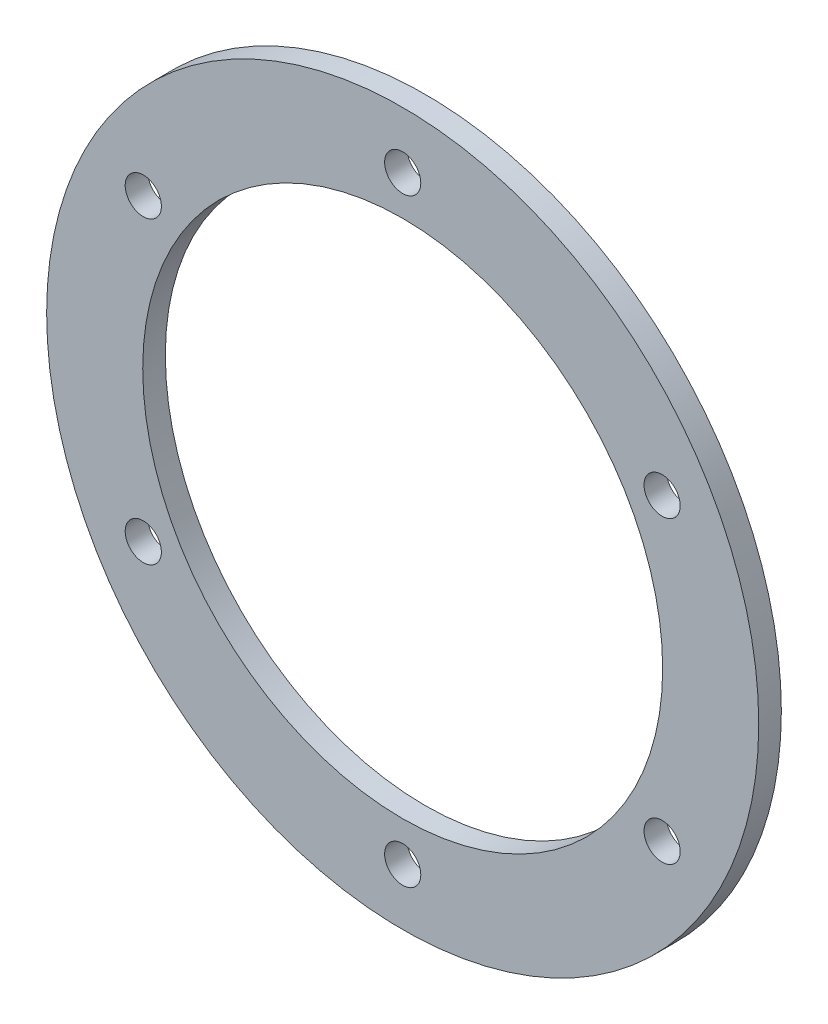
ISO-10303-21;
HEADER;
FILE_DESCRIPTION(('STEP AP214'),'2;1');
FILE_NAME('part.step','',(''),(''),'','','');
FILE_SCHEMA(('AUTOMOTIVE_DESIGN { 1 0 10303 214 1 1 1 1 }'));
ENDSEC;
DATA;
#1=APPLICATION_CONTEXT('core data for automotive mechanical design processes');
#2=APPLICATION_PROTOCOL_DEFINITION('international standard','automotive_design',2000,#1);
#3=PRODUCT_CONTEXT('',#1,'mechanical');
#4=PRODUCT('Part','Part','',(#3));
#5=PRODUCT_RELATED_PRODUCT_CATEGORY('part','',(#4));
#6=PRODUCT_DEFINITION_FORMATION('','',#4);
#7=PRODUCT_DEFINITION_CONTEXT('part definition',#1,'design');
#8=PRODUCT_DEFINITION('design','',#6,#7);
#9=PRODUCT_DEFINITION_SHAPE('','',#8);
#10=(LENGTH_UNIT() NAMED_UNIT(*) SI_UNIT(.MILLI.,.METRE.));
#11=(NAMED_UNIT(*) PLANE_ANGLE_UNIT() SI_UNIT($,.RADIAN.));
#12=(NAMED_UNIT(*) SI_UNIT($,.STERADIAN.) SOLID_ANGLE_UNIT());
#13=UNCERTAINTY_MEASURE_WITH_UNIT(LENGTH_MEASURE(1.E-05),#10,'distance_accuracy_value','');
#14=(GEOMETRIC_REPRESENTATION_CONTEXT(3) GLOBAL_UNCERTAINTY_ASSIGNED_CONTEXT((#13)) GLOBAL_UNIT_ASSIGNED_CONTEXT((#10,
#11,#12)) REPRESENTATION_CONTEXT('',''));
#15=CARTESIAN_POINT('',(0.,0.,0.));
#16=DIRECTION('',(0.,0.,1.));
#17=DIRECTION('',(1.,0.,0.));
#18=AXIS2_PLACEMENT_3D('',#15,#16,#17);
#19=CARTESIAN_POINT('',(0.,0.,2.));
#20=DIRECTION('',(0.,0.,1.));
#21=DIRECTION('',(1.,0.,0.));
#22=AXIS2_PLACEMENT_3D('',#19,#20,#21);
#23=PLANE('',#22);
#24=CARTESIAN_POINT('',(-22.9496732002876,-13.25,2.));
#25=DIRECTION('',(0.,0.,1.));
#26=DIRECTION('',(1.,0.,0.));
#27=AXIS2_PLACEMENT_3D('',#24,#25,#26);
#28=CIRCLE('',#27,1.6);
#29=CARTESIAN_POINT('',(-21.3496732002876,-13.25,2.));
#30=VERTEX_POINT('',#29);
#31=EDGE_CURVE('E72',#30,#30,#28,.T.);
#32=ORIENTED_EDGE('',*,*,#31,.F.);
#33=EDGE_LOOP('',(#32));
#34=FACE_BOUND('',#33,.T.);
#35=CARTESIAN_POINT('',(22.9496732002876,-13.25,2.));
#36=DIRECTION('',(0.,0.,1.));
#37=DIRECTION('',(1.,0.,0.));
#38=AXIS2_PLACEMENT_3D('',#35,#36,#37);
#39=CIRCLE('',#38,1.6);
#40=CARTESIAN_POINT('',(24.5496732002876,-13.25,2.));
#41=VERTEX_POINT('',#40);
#42=EDGE_CURVE('E60',#41,#41,#39,.T.);
#43=ORIENTED_EDGE('',*,*,#42,.F.);
#44=EDGE_LOOP('',(#43));
#45=FACE_BOUND('',#44,.T.);
#46=CARTESIAN_POINT('',(0.,26.5,2.));
#47=DIRECTION('',(0.,0.,1.));
#48=DIRECTION('',(1.,0.,0.));
#49=AXIS2_PLACEMENT_3D('',#46,#47,#48);
#50=CIRCLE('',#49,1.6);
#51=CARTESIAN_POINT('',(1.6,26.5,2.));
#52=VERTEX_POINT('',#51);
#53=EDGE_CURVE('E48',#52,#52,#50,.T.);
#54=ORIENTED_EDGE('',*,*,#53,.F.);
#55=EDGE_LOOP('',(#54));
#56=FACE_BOUND('',#55,.T.);
#57=CARTESIAN_POINT('',(0.,0.,2.));
#58=DIRECTION('',(0.,0.,1.));
#59=DIRECTION('',(1.,0.,0.));
#60=AXIS2_PLACEMENT_3D('',#57,#58,#59);
#61=CIRCLE('',#60,31.5);
#62=CARTESIAN_POINT('',(31.5,0.,2.));
#63=VERTEX_POINT('',#62);
#64=EDGE_CURVE('E10',#63,#63,#61,.T.);
#65=ORIENTED_EDGE('',*,*,#64,.T.);
#66=EDGE_LOOP('',(#65));
#67=FACE_BOUND('',#66,.T.);
#68=CARTESIAN_POINT('',(0.,0.,2.));
#69=DIRECTION('',(0.,0.,1.));
#70=DIRECTION('',(1.,0.,0.));
#71=AXIS2_PLACEMENT_3D('',#68,#69,#70);
#72=CIRCLE('',#71,23.);
#73=CARTESIAN_POINT('',(23.,0.,2.));
#74=VERTEX_POINT('',#73);
#75=EDGE_CURVE('E43',#74,#74,#72,.T.);
#76=ORIENTED_EDGE('',*,*,#75,.F.);
#77=EDGE_LOOP('',(#76));
#78=FACE_BOUND('',#77,.T.);
#79=CARTESIAN_POINT('',(22.9496732002876,13.25,2.));
#80=DIRECTION('',(0.,0.,1.));
#81=DIRECTION('',(1.,0.,0.));
#82=AXIS2_PLACEMENT_3D('',#79,#80,#81);
#83=CIRCLE('',#82,1.6);
#84=CARTESIAN_POINT('',(24.5496732002876,13.25,2.));
#85=VERTEX_POINT('',#84);
#86=EDGE_CURVE('E54',#85,#85,#83,.T.);
#87=ORIENTED_EDGE('',*,*,#86,.F.);
#88=EDGE_LOOP('',(#87));
#89=FACE_BOUND('',#88,.T.);
#90=CARTESIAN_POINT('',(0.,-26.5,2.));
#91=DIRECTION('',(0.,0.,1.));
#92=DIRECTION('',(1.,0.,0.));
#93=AXIS2_PLACEMENT_3D('',#90,#91,#92);
#94=CIRCLE('',#93,1.6);
#95=CARTESIAN_POINT('',(1.6,-26.5,2.));
#96=VERTEX_POINT('',#95);
#97=EDGE_CURVE('E66',#96,#96,#94,.T.);
#98=ORIENTED_EDGE('',*,*,#97,.F.);
#99=EDGE_LOOP('',(#98));
#100=FACE_BOUND('',#99,.T.);
#101=CARTESIAN_POINT('',(-22.9496732002876,13.25,2.));
#102=DIRECTION('',(0.,0.,1.));
#103=DIRECTION('',(1.,0.,0.));
#104=AXIS2_PLACEMENT_3D('',#101,#102,#103);
#105=CIRCLE('',#104,1.6);
#106=CARTESIAN_POINT('',(-21.3496732002876,13.25,2.));
#107=VERTEX_POINT('',#106);
#108=EDGE_CURVE('E78',#107,#107,#105,.T.);
#109=ORIENTED_EDGE('',*,*,#108,.F.);
#110=EDGE_LOOP('',(#109));
#111=FACE_BOUND('',#110,.T.);
#112=ADVANCED_FACE('F32',(#34,#45,#56,#67,#78,#89,#100,#111),#23,.T.);
#113=CARTESIAN_POINT('',(0.,0.,0.));
#114=DIRECTION('',(0.,0.,1.));
#115=DIRECTION('',(1.,0.,0.));
#116=AXIS2_PLACEMENT_3D('',#113,#114,#115);
#117=PLANE('',#116);
#118=CARTESIAN_POINT('',(0.,0.,0.));
#119=DIRECTION('',(0.,0.,1.));
#120=DIRECTION('',(1.,0.,0.));
#121=AXIS2_PLACEMENT_3D('',#118,#119,#120);
#122=CIRCLE('',#121,31.5);
#123=CARTESIAN_POINT('',(31.5,0.,0.));
#124=VERTEX_POINT('',#123);
#125=EDGE_CURVE('E36',#124,#124,#122,.T.);
#126=ORIENTED_EDGE('',*,*,#125,.F.);
#127=EDGE_LOOP('',(#126));
#128=FACE_BOUND('',#127,.T.);
#129=CARTESIAN_POINT('',(0.,0.,0.));
#130=DIRECTION('',(0.,0.,1.));
#131=DIRECTION('',(1.,0.,0.));
#132=AXIS2_PLACEMENT_3D('',#129,#130,#131);
#133=CIRCLE('',#132,23.);
#134=CARTESIAN_POINT('',(23.,0.,0.));
#135=VERTEX_POINT('',#134);
#136=EDGE_CURVE('E45',#135,#135,#133,.T.);
#137=ORIENTED_EDGE('',*,*,#136,.T.);
#138=EDGE_LOOP('',(#137));
#139=FACE_BOUND('',#138,.T.);
#140=CARTESIAN_POINT('',(0.,26.5,0.));
#141=DIRECTION('',(0.,0.,1.));
#142=DIRECTION('',(1.,0.,0.));
#143=AXIS2_PLACEMENT_3D('',#140,#141,#142);
#144=CIRCLE('',#143,1.6);
#145=CARTESIAN_POINT('',(1.6,26.5,0.));
#146=VERTEX_POINT('',#145);
#147=EDGE_CURVE('E51',#146,#146,#144,.T.);
#148=ORIENTED_EDGE('',*,*,#147,.T.);
#149=EDGE_LOOP('',(#148));
#150=FACE_BOUND('',#149,.T.);
#151=CARTESIAN_POINT('',(22.9496732002876,13.25,0.));
#152=DIRECTION('',(0.,0.,1.));
#153=DIRECTION('',(1.,0.,0.));
#154=AXIS2_PLACEMENT_3D('',#151,#152,#153);
#155=CIRCLE('',#154,1.6);
#156=CARTESIAN_POINT('',(24.5496732002876,13.25,0.));
#157=VERTEX_POINT('',#156);
#158=EDGE_CURVE('E57',#157,#157,#155,.T.);
#159=ORIENTED_EDGE('',*,*,#158,.T.);
#160=EDGE_LOOP('',(#159));
#161=FACE_BOUND('',#160,.T.);
#162=CARTESIAN_POINT('',(22.9496732002876,-13.25,0.));
#163=DIRECTION('',(0.,0.,1.));
#164=DIRECTION('',(1.,0.,0.));
#165=AXIS2_PLACEMENT_3D('',#162,#163,#164);
#166=CIRCLE('',#165,1.6);
#167=CARTESIAN_POINT('',(24.5496732002876,-13.25,0.));
#168=VERTEX_POINT('',#167);
#169=EDGE_CURVE('E63',#168,#168,#166,.T.);
#170=ORIENTED_EDGE('',*,*,#169,.T.);
#171=EDGE_LOOP('',(#170));
#172=FACE_BOUND('',#171,.T.);
#173=CARTESIAN_POINT('',(0.,-26.5,0.));
#174=DIRECTION('',(0.,0.,1.));
#175=DIRECTION('',(1.,0.,0.));
#176=AXIS2_PLACEMENT_3D('',#173,#174,#175);
#177=CIRCLE('',#176,1.6);
#178=CARTESIAN_POINT('',(1.6,-26.5,0.));
#179=VERTEX_POINT('',#178);
#180=EDGE_CURVE('E69',#179,#179,#177,.T.);
#181=ORIENTED_EDGE('',*,*,#180,.T.);
#182=EDGE_LOOP('',(#181));
#183=FACE_BOUND('',#182,.T.);
#184=CARTESIAN_POINT('',(-22.9496732002876,-13.25,0.));
#185=DIRECTION('',(0.,0.,1.));
#186=DIRECTION('',(1.,0.,0.));
#187=AXIS2_PLACEMENT_3D('',#184,#185,#186);
#188=CIRCLE('',#187,1.6);
#189=CARTESIAN_POINT('',(-21.3496732002876,-13.25,0.));
#190=VERTEX_POINT('',#189);
#191=EDGE_CURVE('E75',#190,#190,#188,.T.);
#192=ORIENTED_EDGE('',*,*,#191,.T.);
#193=EDGE_LOOP('',(#192));
#194=FACE_BOUND('',#193,.T.);
#195=CARTESIAN_POINT('',(-22.9496732002876,13.25,0.));
#196=DIRECTION('',(0.,0.,1.));
#197=DIRECTION('',(1.,0.,0.));
#198=AXIS2_PLACEMENT_3D('',#195,#196,#197);
#199=CIRCLE('',#198,1.6);
#200=CARTESIAN_POINT('',(-21.3496732002876,13.25,0.));
#201=VERTEX_POINT('',#200);
#202=EDGE_CURVE('E81',#201,#201,#199,.T.);
#203=ORIENTED_EDGE('',*,*,#202,.T.);
#204=EDGE_LOOP('',(#203));
#205=FACE_BOUND('',#204,.T.);
#206=ADVANCED_FACE('F91',(#128,#139,#150,#161,#172,#183,#194,#205),#117,.F.);
#207=CARTESIAN_POINT('',(0.,0.,2.));
#208=DIRECTION('',(0.,0.,-1.));
#209=DIRECTION('',(-1.,0.,0.));
#210=AXIS2_PLACEMENT_3D('',#207,#208,#209);
#211=CYLINDRICAL_SURFACE('',#210,31.5);
#212=ORIENTED_EDGE('',*,*,#64,.F.);
#213=EDGE_LOOP('',(#212));
#214=FACE_BOUND('',#213,.T.);
#215=ORIENTED_EDGE('',*,*,#125,.T.);
#216=EDGE_LOOP('',(#215));
#217=FACE_BOUND('',#216,.T.);
#218=ADVANCED_FACE('F34',(#214,#217),#211,.T.);
#219=CARTESIAN_POINT('',(0.,0.,2.));
#220=DIRECTION('',(0.,0.,-1.));
#221=DIRECTION('',(-1.,0.,0.));
#222=AXIS2_PLACEMENT_3D('',#219,#220,#221);
#223=CYLINDRICAL_SURFACE('',#222,23.);
#224=ORIENTED_EDGE('',*,*,#75,.T.);
#225=EDGE_LOOP('',(#224));
#226=FACE_BOUND('',#225,.T.);
#227=ORIENTED_EDGE('',*,*,#136,.F.);
#228=EDGE_LOOP('',(#227));
#229=FACE_BOUND('',#228,.T.);
#230=ADVANCED_FACE('F101',(#226,#229),#223,.F.);
#231=CARTESIAN_POINT('',(0.,26.5,2.));
#232=DIRECTION('',(0.,0.,-1.));
#233=DIRECTION('',(-1.,0.,0.));
#234=AXIS2_PLACEMENT_3D('',#231,#232,#233);
#235=CYLINDRICAL_SURFACE('',#234,1.6);
#236=ORIENTED_EDGE('',*,*,#53,.T.);
#237=EDGE_LOOP('',(#236));
#238=FACE_BOUND('',#237,.T.);
#239=ORIENTED_EDGE('',*,*,#147,.F.);
#240=EDGE_LOOP('',(#239));
#241=FACE_BOUND('',#240,.T.);
#242=ADVANCED_FACE('F104',(#238,#241),#235,.F.);
#243=CARTESIAN_POINT('',(22.9496732002876,13.25,2.));
#244=DIRECTION('',(0.,0.,-1.));
#245=DIRECTION('',(-1.,0.,0.));
#246=AXIS2_PLACEMENT_3D('',#243,#244,#245);
#247=CYLINDRICAL_SURFACE('',#246,1.6);
#248=ORIENTED_EDGE('',*,*,#86,.T.);
#249=EDGE_LOOP('',(#248));
#250=FACE_BOUND('',#249,.T.);
#251=ORIENTED_EDGE('',*,*,#158,.F.);
#252=EDGE_LOOP('',(#251));
#253=FACE_BOUND('',#252,.T.);
#254=ADVANCED_FACE('F108',(#250,#253),#247,.F.);
#255=CARTESIAN_POINT('',(22.9496732002876,-13.25,2.));
#256=DIRECTION('',(0.,0.,-1.));
#257=DIRECTION('',(-1.,0.,0.));
#258=AXIS2_PLACEMENT_3D('',#255,#256,#257);
#259=CYLINDRICAL_SURFACE('',#258,1.6);
#260=ORIENTED_EDGE('',*,*,#42,.T.);
#261=EDGE_LOOP('',(#260));
#262=FACE_BOUND('',#261,.T.);
#263=ORIENTED_EDGE('',*,*,#169,.F.);
#264=EDGE_LOOP('',(#263));
#265=FACE_BOUND('',#264,.T.);
#266=ADVANCED_FACE('F112',(#262,#265),#259,.F.);
#267=CARTESIAN_POINT('',(0.,-26.5,2.));
#268=DIRECTION('',(0.,0.,-1.));
#269=DIRECTION('',(-1.,0.,0.));
#270=AXIS2_PLACEMENT_3D('',#267,#268,#269);
#271=CYLINDRICAL_SURFACE('',#270,1.6);
#272=ORIENTED_EDGE('',*,*,#97,.T.);
#273=EDGE_LOOP('',(#272));
#274=FACE_BOUND('',#273,.T.);
#275=ORIENTED_EDGE('',*,*,#180,.F.);
#276=EDGE_LOOP('',(#275));
#277=FACE_BOUND('',#276,.T.);
#278=ADVANCED_FACE('F116',(#274,#277),#271,.F.);
#279=CARTESIAN_POINT('',(-22.9496732002876,-13.25,2.));
#280=DIRECTION('',(0.,0.,-1.));
#281=DIRECTION('',(-1.,0.,0.));
#282=AXIS2_PLACEMENT_3D('',#279,#280,#281);
#283=CYLINDRICAL_SURFACE('',#282,1.6);
#284=ORIENTED_EDGE('',*,*,#31,.T.);
#285=EDGE_LOOP('',(#284));
#286=FACE_BOUND('',#285,.T.);
#287=ORIENTED_EDGE('',*,*,#191,.F.);
#288=EDGE_LOOP('',(#287));
#289=FACE_BOUND('',#288,.T.);
#290=ADVANCED_FACE('F120',(#286,#289),#283,.F.);
#291=CARTESIAN_POINT('',(-22.9496732002876,13.25,2.));
#292=DIRECTION('',(0.,0.,-1.));
#293=DIRECTION('',(-1.,0.,0.));
#294=AXIS2_PLACEMENT_3D('',#291,#292,#293);
#295=CYLINDRICAL_SURFACE('',#294,1.6);
#296=ORIENTED_EDGE('',*,*,#108,.T.);
#297=EDGE_LOOP('',(#296));
#298=FACE_BOUND('',#297,.T.);
#299=ORIENTED_EDGE('',*,*,#202,.F.);
#300=EDGE_LOOP('',(#299));
#301=FACE_BOUND('',#300,.T.);
#302=ADVANCED_FACE('F87',(#298,#301),#295,.F.);
#303=CLOSED_SHELL('',(#112,#206,#218,#230,#242,#254,#266,#278,#290,#302));
#304=MANIFOLD_SOLID_BREP('B2',#303);
#305=ADVANCED_BREP_SHAPE_REPRESENTATION('',(#18,#304),#14);
#306=SHAPE_DEFINITION_REPRESENTATION(#9,#305);
ENDSEC;
END-ISO-10303-21;
